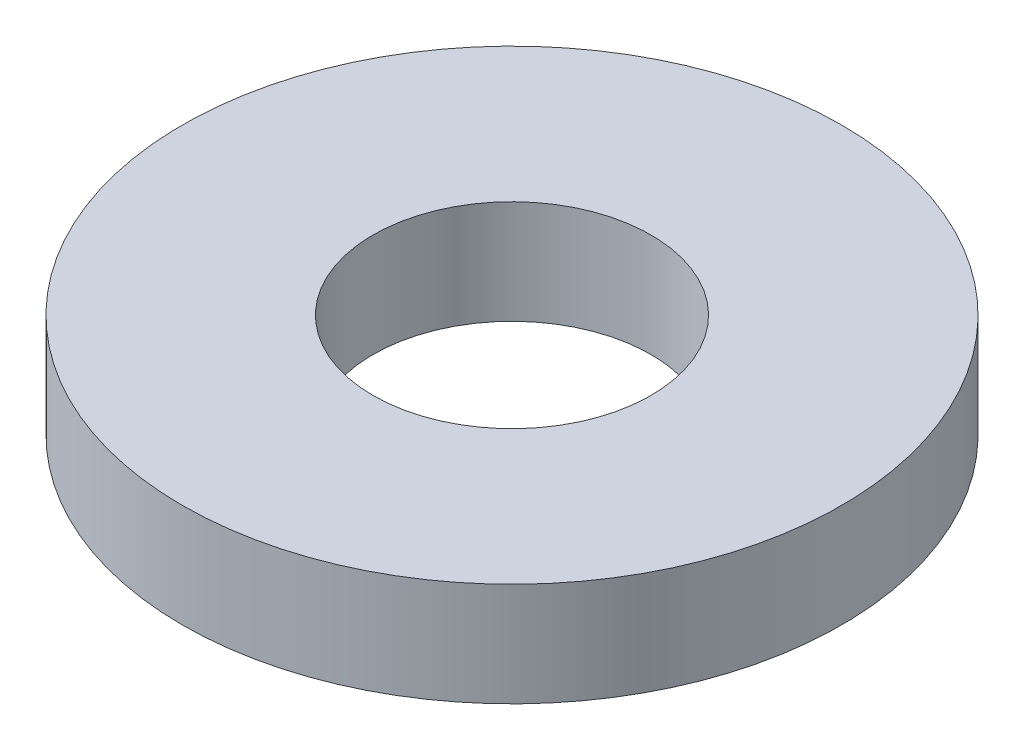
ISO-10303-21;
HEADER;
FILE_DESCRIPTION(('STEP AP214'),'2;1');
FILE_NAME('part.step','',(''),(''),'','','');
FILE_SCHEMA(('AUTOMOTIVE_DESIGN { 1 0 10303 214 1 1 1 1 }'));
ENDSEC;
DATA;
#1=APPLICATION_CONTEXT('core data for automotive mechanical design processes');
#2=APPLICATION_PROTOCOL_DEFINITION('international standard','automotive_design',2000,#1);
#3=PRODUCT_CONTEXT('',#1,'mechanical');
#4=PRODUCT('Part','Part','',(#3));
#5=PRODUCT_RELATED_PRODUCT_CATEGORY('part','',(#4));
#6=PRODUCT_DEFINITION_FORMATION('','',#4);
#7=PRODUCT_DEFINITION_CONTEXT('part definition',#1,'design');
#8=PRODUCT_DEFINITION('design','',#6,#7);
#9=PRODUCT_DEFINITION_SHAPE('','',#8);
#10=(LENGTH_UNIT() NAMED_UNIT(*) SI_UNIT(.MILLI.,.METRE.));
#11=(NAMED_UNIT(*) PLANE_ANGLE_UNIT() SI_UNIT($,.RADIAN.));
#12=(NAMED_UNIT(*) SI_UNIT($,.STERADIAN.) SOLID_ANGLE_UNIT());
#13=UNCERTAINTY_MEASURE_WITH_UNIT(LENGTH_MEASURE(1.E-05),#10,'distance_accuracy_value','');
#14=(GEOMETRIC_REPRESENTATION_CONTEXT(3) GLOBAL_UNCERTAINTY_ASSIGNED_CONTEXT((#13)) GLOBAL_UNIT_ASSIGNED_CONTEXT((#10,
#11,#12)) REPRESENTATION_CONTEXT('',''));
#15=CARTESIAN_POINT('',(0.,0.,0.));
#16=DIRECTION('',(0.,0.,1.));
#17=DIRECTION('',(1.,0.,0.));
#18=AXIS2_PLACEMENT_3D('',#15,#16,#17);
#19=CARTESIAN_POINT('',(0.,5.588,0.));
#20=DIRECTION('',(0.,1.,0.));
#21=DIRECTION('',(0.,0.,1.));
#22=AXIS2_PLACEMENT_3D('',#19,#20,#21);
#23=PLANE('',#22);
#24=CARTESIAN_POINT('',(0.,5.588,0.));
#25=DIRECTION('',(0.,1.,0.));
#26=DIRECTION('',(0.,0.,1.));
#27=AXIS2_PLACEMENT_3D('',#24,#25,#26);
#28=CIRCLE('',#27,17.78);
#29=CARTESIAN_POINT('',(0.,5.588,17.78));
#30=VERTEX_POINT('',#29);
#31=EDGE_CURVE('E10',#30,#30,#28,.T.);
#32=ORIENTED_EDGE('',*,*,#31,.T.);
#33=EDGE_LOOP('',(#32));
#34=FACE_BOUND('',#33,.T.);
#35=CARTESIAN_POINT('',(0.,5.588,0.));
#36=DIRECTION('',(0.,1.,0.));
#37=DIRECTION('',(0.,0.,1.));
#38=AXIS2_PLACEMENT_3D('',#35,#36,#37);
#39=CIRCLE('',#38,7.5);
#40=CARTESIAN_POINT('',(0.,5.588,7.5));
#41=VERTEX_POINT('',#40);
#42=EDGE_CURVE('E42',#41,#41,#39,.T.);
#43=ORIENTED_EDGE('',*,*,#42,.F.);
#44=EDGE_LOOP('',(#43));
#45=FACE_BOUND('',#44,.T.);
#46=ADVANCED_FACE('F31',(#34,#45),#23,.T.);
#47=CARTESIAN_POINT('',(0.,0.,0.));
#48=DIRECTION('',(0.,1.,0.));
#49=DIRECTION('',(0.,0.,1.));
#50=AXIS2_PLACEMENT_3D('',#47,#48,#49);
#51=PLANE('',#50);
#52=CARTESIAN_POINT('',(0.,0.,0.));
#53=DIRECTION('',(0.,1.,0.));
#54=DIRECTION('',(0.,0.,1.));
#55=AXIS2_PLACEMENT_3D('',#52,#53,#54);
#56=CIRCLE('',#55,17.78);
#57=CARTESIAN_POINT('',(0.,0.,17.78));
#58=VERTEX_POINT('',#57);
#59=EDGE_CURVE('E35',#58,#58,#56,.T.);
#60=ORIENTED_EDGE('',*,*,#59,.F.);
#61=EDGE_LOOP('',(#60));
#62=FACE_BOUND('',#61,.T.);
#63=CARTESIAN_POINT('',(0.,0.,0.));
#64=DIRECTION('',(0.,1.,0.));
#65=DIRECTION('',(0.,0.,1.));
#66=AXIS2_PLACEMENT_3D('',#63,#64,#65);
#67=CIRCLE('',#66,7.5);
#68=CARTESIAN_POINT('',(0.,0.,7.5));
#69=VERTEX_POINT('',#68);
#70=EDGE_CURVE('E44',#69,#69,#67,.T.);
#71=ORIENTED_EDGE('',*,*,#70,.T.);
#72=EDGE_LOOP('',(#71));
#73=FACE_BOUND('',#72,.T.);
#74=ADVANCED_FACE('F54',(#62,#73),#51,.F.);
#75=CARTESIAN_POINT('',(0.,5.588,0.));
#76=DIRECTION('',(0.,-1.,0.));
#77=DIRECTION('',(0.,0.,-1.));
#78=AXIS2_PLACEMENT_3D('',#75,#76,#77);
#79=CYLINDRICAL_SURFACE('',#78,17.78);
#80=ORIENTED_EDGE('',*,*,#31,.F.);
#81=EDGE_LOOP('',(#80));
#82=FACE_BOUND('',#81,.T.);
#83=ORIENTED_EDGE('',*,*,#59,.T.);
#84=EDGE_LOOP('',(#83));
#85=FACE_BOUND('',#84,.T.);
#86=ADVANCED_FACE('F33',(#82,#85),#79,.T.);
#87=CARTESIAN_POINT('',(0.,5.588,0.));
#88=DIRECTION('',(0.,-1.,0.));
#89=DIRECTION('',(0.,0.,-1.));
#90=AXIS2_PLACEMENT_3D('',#87,#88,#89);
#91=CYLINDRICAL_SURFACE('',#90,7.5);
#92=ORIENTED_EDGE('',*,*,#42,.T.);
#93=EDGE_LOOP('',(#92));
#94=FACE_BOUND('',#93,.T.);
#95=ORIENTED_EDGE('',*,*,#70,.F.);
#96=EDGE_LOOP('',(#95));
#97=FACE_BOUND('',#96,.T.);
#98=ADVANCED_FACE('F50',(#94,#97),#91,.F.);
#99=CLOSED_SHELL('',(#46,#74,#86,#98));
#100=MANIFOLD_SOLID_BREP('B2',#99);
#101=ADVANCED_BREP_SHAPE_REPRESENTATION('',(#18,#100),#14);
#102=SHAPE_DEFINITION_REPRESENTATION(#9,#101);
ENDSEC;
END-ISO-10303-21;
